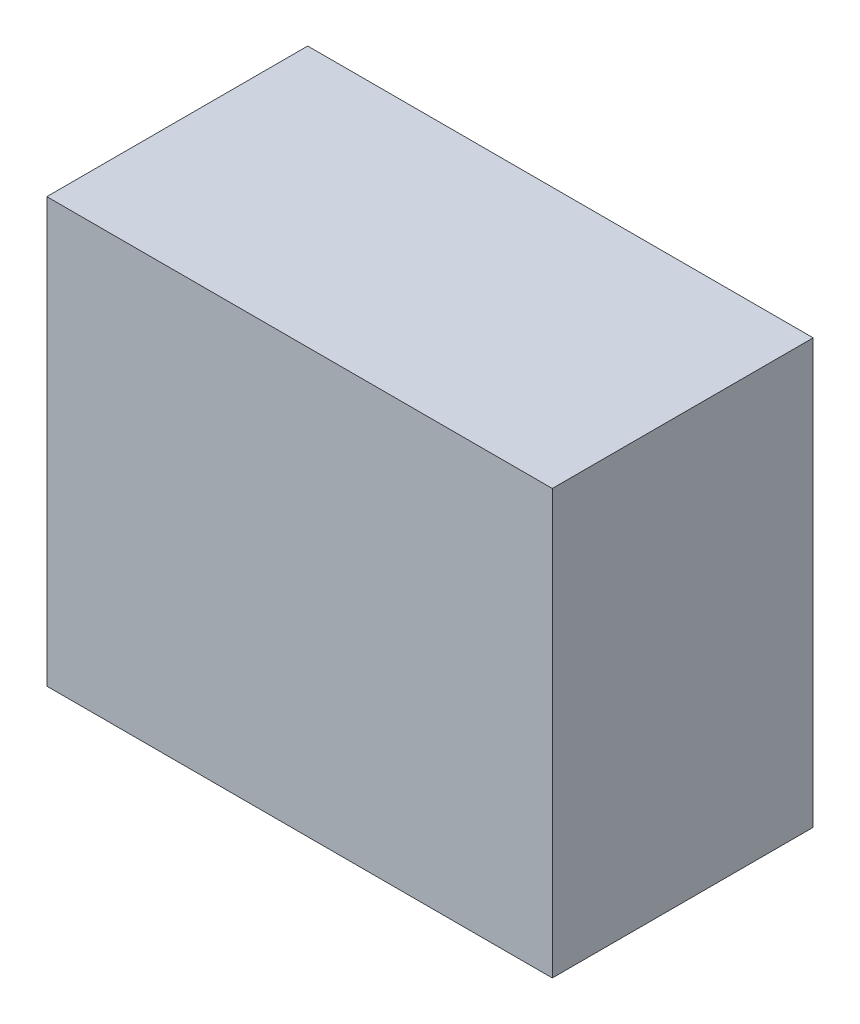
ISO-10303-21;
HEADER;
FILE_DESCRIPTION(('STEP AP214'),'2;1');
FILE_NAME('part.step','',(''),(''),'','','');
FILE_SCHEMA(('AUTOMOTIVE_DESIGN { 1 0 10303 214 1 1 1 1 }'));
ENDSEC;
DATA;
#1=APPLICATION_CONTEXT('core data for automotive mechanical design processes');
#2=APPLICATION_PROTOCOL_DEFINITION('international standard','automotive_design',2000,#1);
#3=PRODUCT_CONTEXT('',#1,'mechanical');
#4=PRODUCT('Part','Part','',(#3));
#5=PRODUCT_RELATED_PRODUCT_CATEGORY('part','',(#4));
#6=PRODUCT_DEFINITION_FORMATION('','',#4);
#7=PRODUCT_DEFINITION_CONTEXT('part definition',#1,'design');
#8=PRODUCT_DEFINITION('design','',#6,#7);
#9=PRODUCT_DEFINITION_SHAPE('','',#8);
#10=(LENGTH_UNIT() NAMED_UNIT(*) SI_UNIT(.MILLI.,.METRE.));
#11=(NAMED_UNIT(*) PLANE_ANGLE_UNIT() SI_UNIT($,.RADIAN.));
#12=(NAMED_UNIT(*) SI_UNIT($,.STERADIAN.) SOLID_ANGLE_UNIT());
#13=UNCERTAINTY_MEASURE_WITH_UNIT(LENGTH_MEASURE(1.E-05),#10,'distance_accuracy_value','');
#14=(GEOMETRIC_REPRESENTATION_CONTEXT(3) GLOBAL_UNCERTAINTY_ASSIGNED_CONTEXT((#13)) GLOBAL_UNIT_ASSIGNED_CONTEXT((#10,
#11,#12)) REPRESENTATION_CONTEXT('',''));
#15=CARTESIAN_POINT('',(0.,0.,0.));
#16=DIRECTION('',(0.,0.,1.));
#17=DIRECTION('',(1.,0.,0.));
#18=AXIS2_PLACEMENT_3D('',#15,#16,#17);
#19=CARTESIAN_POINT('',(0.,130.,80.));
#20=DIRECTION('',(1.,0.,0.));
#21=DIRECTION('',(0.,0.,-1.));
#22=AXIS2_PLACEMENT_3D('',#19,#20,#21);
#23=PLANE('',#22);
#24=DIRECTION('',(0.,-1.,0.));
#25=VECTOR('',#24,1.);
#26=CARTESIAN_POINT('',(0.,130.,0.));
#27=LINE('',#26,#25);
#28=CARTESIAN_POINT('',(0.,130.,0.));
#29=VERTEX_POINT('',#28);
#30=CARTESIAN_POINT('',(0.,0.,0.));
#31=VERTEX_POINT('',#30);
#32=EDGE_CURVE('E97',#29,#31,#27,.T.);
#33=ORIENTED_EDGE('',*,*,#32,.T.);
#34=DIRECTION('',(0.,0.,-1.));
#35=VECTOR('',#34,1.);
#36=CARTESIAN_POINT('',(0.,0.,80.));
#37=LINE('',#36,#35);
#38=CARTESIAN_POINT('',(0.,0.,80.));
#39=VERTEX_POINT('',#38);
#40=EDGE_CURVE('E11',#39,#31,#37,.T.);
#41=ORIENTED_EDGE('',*,*,#40,.F.);
#42=DIRECTION('',(0.,-1.,0.));
#43=VECTOR('',#42,1.);
#44=CARTESIAN_POINT('',(0.,130.,80.));
#45=LINE('',#44,#43);
#46=CARTESIAN_POINT('',(0.,130.,80.));
#47=VERTEX_POINT('',#46);
#48=EDGE_CURVE('E85',#47,#39,#45,.T.);
#49=ORIENTED_EDGE('',*,*,#48,.F.);
#50=DIRECTION('',(0.,0.,-1.));
#51=VECTOR('',#50,1.);
#52=CARTESIAN_POINT('',(0.,130.,80.));
#53=LINE('',#52,#51);
#54=EDGE_CURVE('E93',#47,#29,#53,.T.);
#55=ORIENTED_EDGE('',*,*,#54,.T.);
#56=EDGE_LOOP('',(#33,#41,#49,#55));
#57=FACE_BOUND('',#56,.T.);
#58=ADVANCED_FACE('F34',(#57),#23,.F.);
#59=CARTESIAN_POINT('',(0.,0.,80.));
#60=DIRECTION('',(0.,1.,0.));
#61=DIRECTION('',(0.,0.,1.));
#62=AXIS2_PLACEMENT_3D('',#59,#60,#61);
#63=PLANE('',#62);
#64=DIRECTION('',(1.,0.,0.));
#65=VECTOR('',#64,1.);
#66=CARTESIAN_POINT('',(0.,0.,0.));
#67=LINE('',#66,#65);
#68=CARTESIAN_POINT('',(155.,0.,0.));
#69=VERTEX_POINT('',#68);
#70=EDGE_CURVE('E89',#31,#69,#67,.T.);
#71=ORIENTED_EDGE('',*,*,#70,.T.);
#72=DIRECTION('',(0.,0.,-1.));
#73=VECTOR('',#72,1.);
#74=CARTESIAN_POINT('',(155.,0.,80.));
#75=LINE('',#74,#73);
#76=CARTESIAN_POINT('',(155.,0.,80.));
#77=VERTEX_POINT('',#76);
#78=EDGE_CURVE('E42',#77,#69,#75,.T.);
#79=ORIENTED_EDGE('',*,*,#78,.F.);
#80=DIRECTION('',(1.,0.,0.));
#81=VECTOR('',#80,1.);
#82=CARTESIAN_POINT('',(0.,0.,80.));
#83=LINE('',#82,#81);
#84=EDGE_CURVE('E80',#39,#77,#83,.T.);
#85=ORIENTED_EDGE('',*,*,#84,.F.);
#86=ORIENTED_EDGE('',*,*,#40,.T.);
#87=EDGE_LOOP('',(#71,#79,#85,#86));
#88=FACE_BOUND('',#87,.T.);
#89=ADVANCED_FACE('F88',(#88),#63,.F.);
#90=CARTESIAN_POINT('',(155.,0.,80.));
#91=DIRECTION('',(-1.,0.,0.));
#92=DIRECTION('',(0.,0.,1.));
#93=AXIS2_PLACEMENT_3D('',#90,#91,#92);
#94=PLANE('',#93);
#95=DIRECTION('',(0.,1.,0.));
#96=VECTOR('',#95,1.);
#97=CARTESIAN_POINT('',(155.,0.,0.));
#98=LINE('',#97,#96);
#99=CARTESIAN_POINT('',(155.,130.,0.));
#100=VERTEX_POINT('',#99);
#101=EDGE_CURVE('E67',#69,#100,#98,.T.);
#102=ORIENTED_EDGE('',*,*,#101,.T.);
#103=DIRECTION('',(0.,0.,-1.));
#104=VECTOR('',#103,1.);
#105=CARTESIAN_POINT('',(155.,130.,80.));
#106=LINE('',#105,#104);
#107=CARTESIAN_POINT('',(155.,130.,80.));
#108=VERTEX_POINT('',#107);
#109=EDGE_CURVE('E90',#108,#100,#106,.T.);
#110=ORIENTED_EDGE('',*,*,#109,.F.);
#111=DIRECTION('',(0.,1.,0.));
#112=VECTOR('',#111,1.);
#113=CARTESIAN_POINT('',(155.,0.,80.));
#114=LINE('',#113,#112);
#115=EDGE_CURVE('E83',#77,#108,#114,.T.);
#116=ORIENTED_EDGE('',*,*,#115,.F.);
#117=ORIENTED_EDGE('',*,*,#78,.T.);
#118=EDGE_LOOP('',(#102,#110,#116,#117));
#119=FACE_BOUND('',#118,.T.);
#120=ADVANCED_FACE('F91',(#119),#94,.F.);
#121=CARTESIAN_POINT('',(155.,130.,80.));
#122=DIRECTION('',(0.,-1.,0.));
#123=DIRECTION('',(0.,0.,-1.));
#124=AXIS2_PLACEMENT_3D('',#121,#122,#123);
#125=PLANE('',#124);
#126=DIRECTION('',(-1.,0.,0.));
#127=VECTOR('',#126,1.);
#128=CARTESIAN_POINT('',(155.,130.,0.));
#129=LINE('',#128,#127);
#130=EDGE_CURVE('E73',#100,#29,#129,.T.);
#131=ORIENTED_EDGE('',*,*,#130,.T.);
#132=ORIENTED_EDGE('',*,*,#54,.F.);
#133=DIRECTION('',(-1.,0.,0.));
#134=VECTOR('',#133,1.);
#135=CARTESIAN_POINT('',(155.,130.,80.));
#136=LINE('',#135,#134);
#137=EDGE_CURVE('E50',#108,#47,#136,.T.);
#138=ORIENTED_EDGE('',*,*,#137,.F.);
#139=ORIENTED_EDGE('',*,*,#109,.T.);
#140=EDGE_LOOP('',(#131,#132,#138,#139));
#141=FACE_BOUND('',#140,.T.);
#142=ADVANCED_FACE('F104',(#141),#125,.F.);
#143=CARTESIAN_POINT('',(0.,0.,80.));
#144=DIRECTION('',(0.,0.,1.));
#145=DIRECTION('',(1.,0.,0.));
#146=AXIS2_PLACEMENT_3D('',#143,#144,#145);
#147=PLANE('',#146);
#148=ORIENTED_EDGE('',*,*,#48,.T.);
#149=ORIENTED_EDGE('',*,*,#84,.T.);
#150=ORIENTED_EDGE('',*,*,#115,.T.);
#151=ORIENTED_EDGE('',*,*,#137,.T.);
#152=EDGE_LOOP('',(#148,#149,#150,#151));
#153=FACE_BOUND('',#152,.T.);
#154=ADVANCED_FACE('F81',(#153),#147,.T.);
#155=CARTESIAN_POINT('',(0.,0.,0.));
#156=DIRECTION('',(0.,0.,1.));
#157=DIRECTION('',(1.,0.,0.));
#158=AXIS2_PLACEMENT_3D('',#155,#156,#157);
#159=PLANE('',#158);
#160=ORIENTED_EDGE('',*,*,#32,.F.);
#161=ORIENTED_EDGE('',*,*,#130,.F.);
#162=ORIENTED_EDGE('',*,*,#101,.F.);
#163=ORIENTED_EDGE('',*,*,#70,.F.);
#164=EDGE_LOOP('',(#160,#161,#162,#163));
#165=FACE_BOUND('',#164,.T.);
#166=ADVANCED_FACE('F107',(#165),#159,.F.);
#167=CLOSED_SHELL('',(#58,#89,#120,#142,#154,#166));
#168=MANIFOLD_SOLID_BREP('B2',#167);
#169=ADVANCED_BREP_SHAPE_REPRESENTATION('',(#18,#168),#14);
#170=SHAPE_DEFINITION_REPRESENTATION(#9,#169);
ENDSEC;
END-ISO-10303-21;
